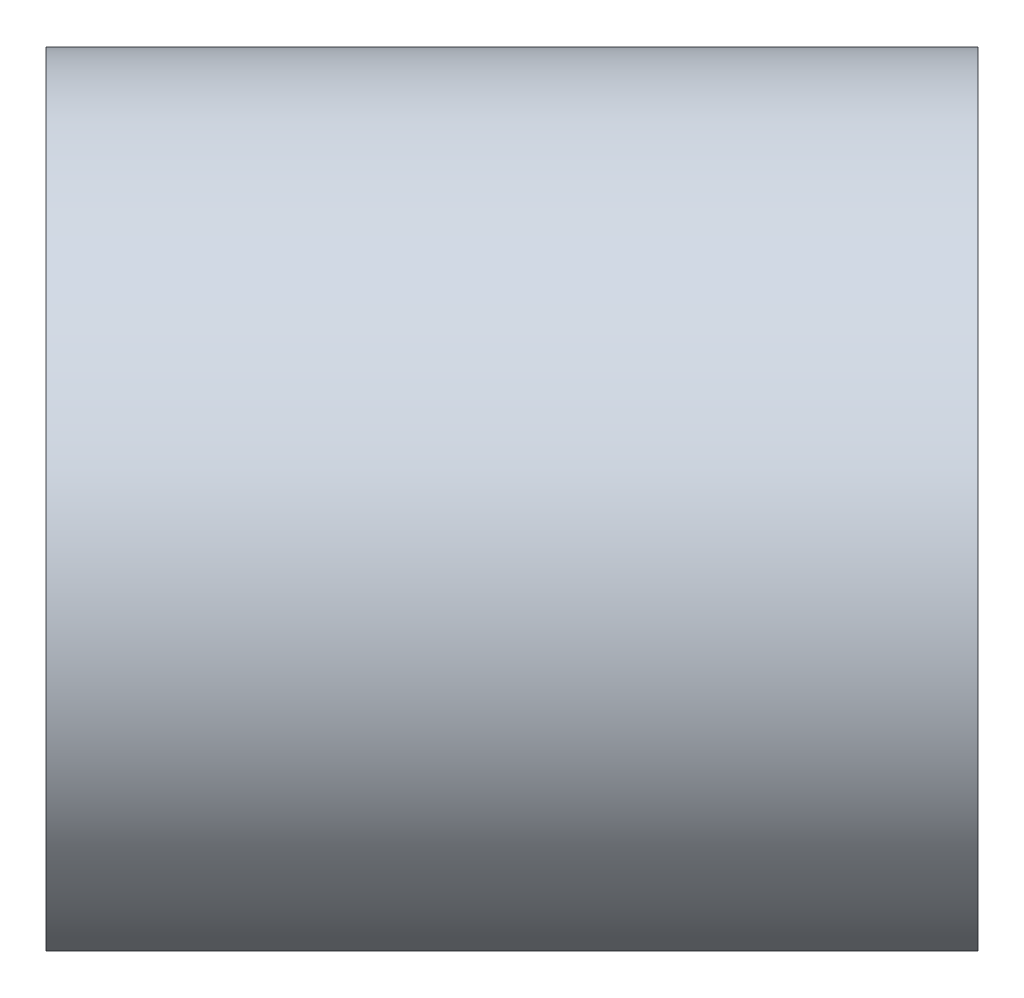
ISO-10303-21;
HEADER;
FILE_DESCRIPTION(('STEP AP214'),'2;1');
FILE_NAME('part.step','',(''),(''),'','','');
FILE_SCHEMA(('AUTOMOTIVE_DESIGN { 1 0 10303 214 1 1 1 1 }'));
ENDSEC;
DATA;
#1=APPLICATION_CONTEXT('core data for automotive mechanical design processes');
#2=APPLICATION_PROTOCOL_DEFINITION('international standard','automotive_design',2000,#1);
#3=PRODUCT_CONTEXT('',#1,'mechanical');
#4=PRODUCT('Part','Part','',(#3));
#5=PRODUCT_RELATED_PRODUCT_CATEGORY('part','',(#4));
#6=PRODUCT_DEFINITION_FORMATION('','',#4);
#7=PRODUCT_DEFINITION_CONTEXT('part definition',#1,'design');
#8=PRODUCT_DEFINITION('design','',#6,#7);
#9=PRODUCT_DEFINITION_SHAPE('','',#8);
#10=(LENGTH_UNIT() NAMED_UNIT(*) SI_UNIT(.MILLI.,.METRE.));
#11=(NAMED_UNIT(*) PLANE_ANGLE_UNIT() SI_UNIT($,.RADIAN.));
#12=(NAMED_UNIT(*) SI_UNIT($,.STERADIAN.) SOLID_ANGLE_UNIT());
#13=UNCERTAINTY_MEASURE_WITH_UNIT(LENGTH_MEASURE(1.E-05),#10,'distance_accuracy_value','');
#14=(GEOMETRIC_REPRESENTATION_CONTEXT(3) GLOBAL_UNCERTAINTY_ASSIGNED_CONTEXT((#13)) GLOBAL_UNIT_ASSIGNED_CONTEXT((#10,
#11,#12)) REPRESENTATION_CONTEXT('',''));
#15=CARTESIAN_POINT('',(0.,0.,0.));
#16=DIRECTION('',(0.,0.,1.));
#17=DIRECTION('',(1.,0.,0.));
#18=AXIS2_PLACEMENT_3D('',#15,#16,#17);
#19=CARTESIAN_POINT('',(310.487188391878,-7.5,9.49581035972025));
#20=DIRECTION('',(-0.707106781186552,0.,0.707106781186543));
#21=DIRECTION('',(0.707106781186543,0.,0.707106781186552));
#22=AXIS2_PLACEMENT_3D('',#19,#20,#21);
#23=CYLINDRICAL_SURFACE('',#22,49.);
#24=CARTESIAN_POINT('',(310.487188391878,-7.5,9.49581035972025));
#25=DIRECTION('',(-0.707106781186552,0.,0.707106781186543));
#26=DIRECTION('',(0.707106781186543,0.,0.707106781186552));
#27=AXIS2_PLACEMENT_3D('',#24,#25,#26);
#28=CIRCLE('',#27,49.);
#29=CARTESIAN_POINT('',(345.135420670019,-7.5,44.1440426378613));
#30=VERTEX_POINT('',#29);
#31=EDGE_CURVE('E10',#30,#30,#28,.T.);
#32=ORIENTED_EDGE('',*,*,#31,.T.);
#33=EDGE_LOOP('',(#32));
#34=FACE_BOUND('',#33,.T.);
#35=CARTESIAN_POINT('',(239.069403492036,-7.5,80.9135952595611));
#36=DIRECTION('',(-0.707106781186552,0.,0.707106781186543));
#37=DIRECTION('',(0.707106781186543,0.,0.707106781186552));
#38=AXIS2_PLACEMENT_3D('',#35,#36,#37);
#39=CIRCLE('',#38,49.);
#40=CARTESIAN_POINT('',(273.717635770177,-7.5,115.561827537702));
#41=VERTEX_POINT('',#40);
#42=EDGE_CURVE('E34',#41,#41,#39,.T.);
#43=ORIENTED_EDGE('',*,*,#42,.F.);
#44=EDGE_LOOP('',(#43));
#45=FACE_BOUND('',#44,.T.);
#46=ADVANCED_FACE('F31',(#34,#45),#23,.T.);
#47=CARTESIAN_POINT('',(310.487188391878,-7.5,9.49581035972025));
#48=DIRECTION('',(-0.707106781186552,0.,0.707106781186543));
#49=DIRECTION('',(0.707106781186543,0.,0.707106781186552));
#50=AXIS2_PLACEMENT_3D('',#47,#48,#49);
#51=PLANE('',#50);
#52=ORIENTED_EDGE('',*,*,#31,.F.);
#53=EDGE_LOOP('',(#52));
#54=FACE_BOUND('',#53,.T.);
#55=ADVANCED_FACE('F46',(#54),#51,.F.);
#56=CARTESIAN_POINT('',(239.069403492036,-7.5,80.9135952595611));
#57=DIRECTION('',(-0.707106781186552,0.,0.707106781186543));
#58=DIRECTION('',(0.707106781186543,0.,0.707106781186552));
#59=AXIS2_PLACEMENT_3D('',#56,#57,#58);
#60=PLANE('',#59);
#61=ORIENTED_EDGE('',*,*,#42,.T.);
#62=EDGE_LOOP('',(#61));
#63=FACE_BOUND('',#62,.T.);
#64=ADVANCED_FACE('F43',(#63),#60,.T.);
#65=CLOSED_SHELL('',(#46,#55,#64));
#66=MANIFOLD_SOLID_BREP('B2',#65);
#67=ADVANCED_BREP_SHAPE_REPRESENTATION('',(#18,#66),#14);
#68=SHAPE_DEFINITION_REPRESENTATION(#9,#67);
ENDSEC;
END-ISO-10303-21;
